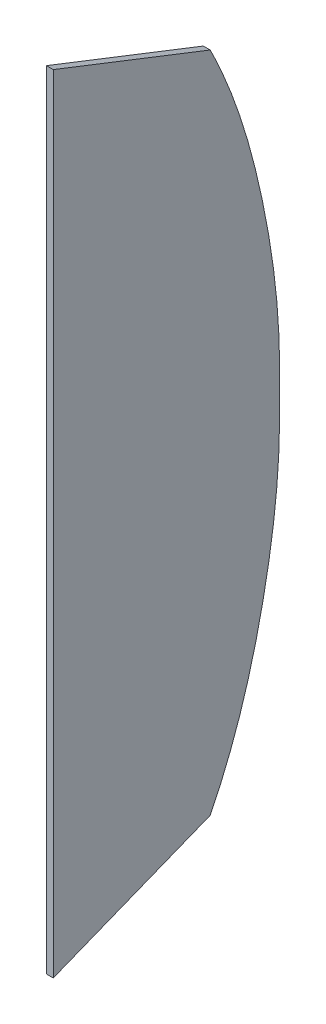
ISO-10303-21;
HEADER;
FILE_DESCRIPTION(('STEP AP214'),'2;1');
FILE_NAME('part.step','',(''),(''),'','','');
FILE_SCHEMA(('AUTOMOTIVE_DESIGN { 1 0 10303 214 1 1 1 1 }'));
ENDSEC;
DATA;
#1=APPLICATION_CONTEXT('core data for automotive mechanical design processes');
#2=APPLICATION_PROTOCOL_DEFINITION('international standard','automotive_design',2000,#1);
#3=PRODUCT_CONTEXT('',#1,'mechanical');
#4=PRODUCT('Part','Part','',(#3));
#5=PRODUCT_RELATED_PRODUCT_CATEGORY('part','',(#4));
#6=PRODUCT_DEFINITION_FORMATION('','',#4);
#7=PRODUCT_DEFINITION_CONTEXT('part definition',#1,'design');
#8=PRODUCT_DEFINITION('design','',#6,#7);
#9=PRODUCT_DEFINITION_SHAPE('','',#8);
#10=(LENGTH_UNIT() NAMED_UNIT(*) SI_UNIT(.MILLI.,.METRE.));
#11=(NAMED_UNIT(*) PLANE_ANGLE_UNIT() SI_UNIT($,.RADIAN.));
#12=(NAMED_UNIT(*) SI_UNIT($,.STERADIAN.) SOLID_ANGLE_UNIT());
#13=UNCERTAINTY_MEASURE_WITH_UNIT(LENGTH_MEASURE(1.E-05),#10,'distance_accuracy_value','');
#14=(GEOMETRIC_REPRESENTATION_CONTEXT(3) GLOBAL_UNCERTAINTY_ASSIGNED_CONTEXT((#13)) GLOBAL_UNIT_ASSIGNED_CONTEXT((#10,
#11,#12)) REPRESENTATION_CONTEXT('',''));
#15=CARTESIAN_POINT('',(0.,0.,0.));
#16=DIRECTION('',(0.,0.,1.));
#17=DIRECTION('',(1.,0.,0.));
#18=AXIS2_PLACEMENT_3D('',#15,#16,#17);
#19=CARTESIAN_POINT('',(9.,-434.591306286478,248.999999691598));
#20=CARTESIAN_POINT('',(9.,-426.266385018669,244.812182663864));
#21=CARTESIAN_POINT('',(9.,-409.423964908326,236.801362844897));
#22=CARTESIAN_POINT('',(9.,-375.149628797293,222.212406313021));
#23=CARTESIAN_POINT('',(9.,-331.259297463056,206.472109959754));
#24=CARTESIAN_POINT('',(9.,-277.308218149153,191.065215125894));
#25=CARTESIAN_POINT('',(9.,-222.427655868533,178.618405136148));
#26=CARTESIAN_POINT('',(9.,-167.061884286646,168.601235655821));
#27=CARTESIAN_POINT('',(9.,-120.681496000962,162.664180797077));
#28=CARTESIAN_POINT('',(9.,-83.4660930358459,159.588454430788));
#29=CARTESIAN_POINT('',(9.,-55.5330096837927,158.191016903717));
#30=CARTESIAN_POINT('',(9.,-27.5061419106363,157.699086860232));
#31=CARTESIAN_POINT('',(9.,0.657149051444837,157.668208507846));
#32=CARTESIAN_POINT('',(9.,28.8204400131948,157.699086883261));
#33=CARTESIAN_POINT('',(9.,56.8473077973295,158.191016915326));
#34=CARTESIAN_POINT('',(9.,84.7803911800562,159.588454358424));
#35=CARTESIAN_POINT('',(9.,121.995794186378,162.664180548182));
#36=CARTESIAN_POINT('',(9.,168.376182512208,168.601235151387));
#37=CARTESIAN_POINT('',(9.,223.741954043314,178.618404527818));
#38=CARTESIAN_POINT('',(9.,278.622516156556,191.065214881807));
#39=CARTESIAN_POINT('',(9.,332.573595341031,206.472110197853));
#40=CARTESIAN_POINT('',(9.,376.463926678336,222.212406757595));
#41=CARTESIAN_POINT('',(9.,410.738262920438,236.801363167192));
#42=CARTESIAN_POINT('',(9.,427.580683135124,244.81218279364));
#43=CARTESIAN_POINT('',(9.,435.905604479438,248.999999691598));
#44=B_SPLINE_CURVE_WITH_KNOTS('',3,(#19,#20,#21,#22,#23,#24,#25,#26,#27,#28,#29,#30,#31,#32,#33,
#34,#35,#36,#37,#38,#39,#40,#41,#42,#43),.UNSPECIFIED.,.F.,.F.,(4,1,1,1,1,1,1,1,1,1,1,1,1,1,1,1,
1,1,1,1,1,1,4),(0.00253448303563442,0.0336260778439174,0.0647176726522003,0.126900862268766,
0.189084051885332,0.251267241501898,0.313450431118464,0.37563362073503,0.406725215543313,
0.437816810351596,0.468908405159879,0.499999999968162,0.531091594776445,0.562183189584728,
0.593274784393011,0.624366379201294,0.68654956881786,0.748732758434425,0.810915948050991,
0.873099137667557,0.935282327284123,0.966373922092406,0.997465516900689),.UNSPECIFIED.);
#45=DIRECTION('',(-1.,0.,0.));
#46=VECTOR('',#45,1.);
#47=SURFACE_OF_LINEAR_EXTRUSION('',#44,#46);
#48=CARTESIAN_POINT('',(0.,-434.591306286478,248.999999691598));
#49=CARTESIAN_POINT('',(0.,-426.266385018669,244.812182663864));
#50=CARTESIAN_POINT('',(0.,-409.423964908326,236.801362844897));
#51=CARTESIAN_POINT('',(0.,-375.149628797293,222.212406313021));
#52=CARTESIAN_POINT('',(0.,-331.259297463056,206.472109959754));
#53=CARTESIAN_POINT('',(0.,-277.308218149153,191.065215125894));
#54=CARTESIAN_POINT('',(0.,-222.427655868533,178.618405136148));
#55=CARTESIAN_POINT('',(0.,-167.061884286646,168.601235655821));
#56=CARTESIAN_POINT('',(0.,-120.681496000962,162.664180797077));
#57=CARTESIAN_POINT('',(0.,-83.4660930358459,159.588454430788));
#58=CARTESIAN_POINT('',(0.,-55.5330096837927,158.191016903717));
#59=CARTESIAN_POINT('',(0.,-27.5061419106363,157.699086860232));
#60=CARTESIAN_POINT('',(0.,0.657149051444837,157.668208507846));
#61=CARTESIAN_POINT('',(0.,28.8204400131948,157.699086883261));
#62=CARTESIAN_POINT('',(0.,56.8473077973295,158.191016915326));
#63=CARTESIAN_POINT('',(0.,84.7803911800562,159.588454358424));
#64=CARTESIAN_POINT('',(0.,121.995794186378,162.664180548182));
#65=CARTESIAN_POINT('',(0.,168.376182512208,168.601235151387));
#66=CARTESIAN_POINT('',(0.,223.741954043314,178.618404527818));
#67=CARTESIAN_POINT('',(0.,278.622516156556,191.065214881807));
#68=CARTESIAN_POINT('',(0.,332.573595341031,206.472110197853));
#69=CARTESIAN_POINT('',(0.,376.463926678336,222.212406757595));
#70=CARTESIAN_POINT('',(0.,410.738262920438,236.801363167192));
#71=CARTESIAN_POINT('',(0.,427.580683135124,244.81218279364));
#72=CARTESIAN_POINT('',(0.,435.905604479438,248.999999691598));
#73=B_SPLINE_CURVE_WITH_KNOTS('',3,(#48,#49,#50,#51,#52,#53,#54,#55,#56,#57,#58,#59,#60,#61,#62,
#63,#64,#65,#66,#67,#68,#69,#70,#71,#72),.UNSPECIFIED.,.F.,.F.,(4,1,1,1,1,1,1,1,1,1,1,1,1,1,1,1,
1,1,1,1,1,1,4),(0.00253448303563442,0.0336260778439174,0.0647176726522003,0.126900862268766,
0.189084051885332,0.251267241501898,0.313450431118464,0.37563362073503,0.406725215543313,
0.437816810351596,0.468908405159879,0.499999999968162,0.531091594776445,0.562183189584728,
0.593274784393011,0.624366379201294,0.68654956881786,0.748732758434425,0.810915948050991,
0.873099137667557,0.935282327284123,0.966373922092406,0.997465516900689),.UNSPECIFIED.);
#74=CARTESIAN_POINT('',(0.,-434.591306286478,248.999999691598));
#75=VERTEX_POINT('',#74);
#76=CARTESIAN_POINT('',(0.,435.905604479438,248.999999691598));
#77=VERTEX_POINT('',#76);
#78=EDGE_CURVE('E96',#75,#77,#73,.T.);
#79=ORIENTED_EDGE('',*,*,#78,.T.);
#80=DIRECTION('',(-1.,0.,0.));
#81=VECTOR('',#80,1.);
#82=CARTESIAN_POINT('',(9.,435.905604479438,248.999999691598));
#83=LINE('',#82,#81);
#84=CARTESIAN_POINT('',(9.,435.905604479438,248.999999691598));
#85=VERTEX_POINT('',#84);
#86=EDGE_CURVE('E11',#85,#77,#83,.T.);
#87=ORIENTED_EDGE('',*,*,#86,.F.);
#88=CARTESIAN_POINT('',(9.,-434.591306286478,248.999999691598));
#89=VERTEX_POINT('',#88);
#90=EDGE_CURVE('E85',#89,#85,#44,.T.);
#91=ORIENTED_EDGE('',*,*,#90,.F.);
#92=DIRECTION('',(-1.,0.,0.));
#93=VECTOR('',#92,1.);
#94=CARTESIAN_POINT('',(9.,-434.591306286478,248.999999691598));
#95=LINE('',#94,#93);
#96=EDGE_CURVE('E93',#89,#75,#95,.T.);
#97=ORIENTED_EDGE('',*,*,#96,.T.);
#98=EDGE_LOOP('',(#79,#87,#91,#97));
#99=FACE_BOUND('',#98,.T.);
#100=ADVANCED_FACE('F33',(#99),#47,.F.);
#101=CARTESIAN_POINT('',(9.,516.556548518137,455.));
#102=DIRECTION('',(0.,-0.931177959031522,0.364564958016935));
#103=DIRECTION('',(0.,-0.364564958016935,-0.931177959031522));
#104=AXIS2_PLACEMENT_3D('',#101,#102,#103);
#105=PLANE('',#104);
#106=DIRECTION('',(0.,0.364564958016935,0.931177959031522));
#107=VECTOR('',#106,1.);
#108=CARTESIAN_POINT('',(0.,516.556548518137,455.));
#109=LINE('',#108,#107);
#110=CARTESIAN_POINT('',(0.,516.556548518137,455.));
#111=VERTEX_POINT('',#110);
#112=EDGE_CURVE('E89',#77,#111,#109,.T.);
#113=ORIENTED_EDGE('',*,*,#112,.T.);
#114=DIRECTION('',(-1.,0.,0.));
#115=VECTOR('',#114,1.);
#116=CARTESIAN_POINT('',(9.,516.556548518137,455.));
#117=LINE('',#116,#115);
#118=CARTESIAN_POINT('',(9.,516.556548518137,455.));
#119=VERTEX_POINT('',#118);
#120=EDGE_CURVE('E42',#119,#111,#117,.T.);
#121=ORIENTED_EDGE('',*,*,#120,.F.);
#122=DIRECTION('',(0.,0.364564958016935,0.931177959031522));
#123=VECTOR('',#122,1.);
#124=CARTESIAN_POINT('',(9.,516.556548518137,455.));
#125=LINE('',#124,#123);
#126=EDGE_CURVE('E80',#85,#119,#125,.T.);
#127=ORIENTED_EDGE('',*,*,#126,.F.);
#128=ORIENTED_EDGE('',*,*,#86,.T.);
#129=EDGE_LOOP('',(#113,#121,#127,#128));
#130=FACE_BOUND('',#129,.T.);
#131=ADVANCED_FACE('F88',(#130),#105,.F.);
#132=CARTESIAN_POINT('',(9.,-516.542644104241,455.));
#133=DIRECTION('',(0.,0.,-1.));
#134=DIRECTION('',(0.,1.,0.));
#135=AXIS2_PLACEMENT_3D('',#132,#133,#134);
#136=PLANE('',#135);
#137=DIRECTION('',(0.,-1.,0.));
#138=VECTOR('',#137,1.);
#139=CARTESIAN_POINT('',(0.,-516.542644104241,455.));
#140=LINE('',#139,#138);
#141=CARTESIAN_POINT('',(0.,-516.542644104241,455.));
#142=VERTEX_POINT('',#141);
#143=EDGE_CURVE('E67',#111,#142,#140,.T.);
#144=ORIENTED_EDGE('',*,*,#143,.T.);
#145=DIRECTION('',(-1.,0.,0.));
#146=VECTOR('',#145,1.);
#147=CARTESIAN_POINT('',(9.,-516.542644104241,455.));
#148=LINE('',#147,#146);
#149=CARTESIAN_POINT('',(9.,-516.542644104241,455.));
#150=VERTEX_POINT('',#149);
#151=EDGE_CURVE('E90',#150,#142,#148,.T.);
#152=ORIENTED_EDGE('',*,*,#151,.F.);
#153=DIRECTION('',(0.,-1.,0.));
#154=VECTOR('',#153,1.);
#155=CARTESIAN_POINT('',(9.,-516.542644104241,455.));
#156=LINE('',#155,#154);
#157=EDGE_CURVE('E83',#119,#150,#156,.T.);
#158=ORIENTED_EDGE('',*,*,#157,.F.);
#159=ORIENTED_EDGE('',*,*,#120,.T.);
#160=EDGE_LOOP('',(#144,#152,#158,#159));
#161=FACE_BOUND('',#160,.T.);
#162=ADVANCED_FACE('F91',(#161),#136,.F.);
#163=CARTESIAN_POINT('',(9.,-516.542644104241,455.));
#164=DIRECTION('',(0.,0.929172883895194,0.369645440704857));
#165=DIRECTION('',(0.,-0.369645440704857,0.929172883895194));
#166=AXIS2_PLACEMENT_3D('',#163,#164,#165);
#167=PLANE('',#166);
#168=DIRECTION('',(0.,0.369645440704857,-0.929172883895194));
#169=VECTOR('',#168,1.);
#170=CARTESIAN_POINT('',(0.,-516.542644104241,455.));
#171=LINE('',#170,#169);
#172=EDGE_CURVE('E73',#142,#75,#171,.T.);
#173=ORIENTED_EDGE('',*,*,#172,.T.);
#174=ORIENTED_EDGE('',*,*,#96,.F.);
#175=DIRECTION('',(0.,0.369645440704857,-0.929172883895194));
#176=VECTOR('',#175,1.);
#177=CARTESIAN_POINT('',(9.,-516.542644104241,455.));
#178=LINE('',#177,#176);
#179=EDGE_CURVE('E50',#150,#89,#178,.T.);
#180=ORIENTED_EDGE('',*,*,#179,.F.);
#181=ORIENTED_EDGE('',*,*,#151,.T.);
#182=EDGE_LOOP('',(#173,#174,#180,#181));
#183=FACE_BOUND('',#182,.T.);
#184=ADVANCED_FACE('F108',(#183),#167,.F.);
#185=CARTESIAN_POINT('',(9.,0.657149051389639,157.678501295813));
#186=DIRECTION('',(1.,0.,0.));
#187=DIRECTION('',(0.,0.,-1.));
#188=AXIS2_PLACEMENT_3D('',#185,#186,#187);
#189=PLANE('',#188);
#190=ORIENTED_EDGE('',*,*,#90,.T.);
#191=ORIENTED_EDGE('',*,*,#126,.T.);
#192=ORIENTED_EDGE('',*,*,#157,.T.);
#193=ORIENTED_EDGE('',*,*,#179,.T.);
#194=EDGE_LOOP('',(#190,#191,#192,#193));
#195=FACE_BOUND('',#194,.T.);
#196=ADVANCED_FACE('F81',(#195),#189,.T.);
#197=CARTESIAN_POINT('',(0.,0.657149051389639,157.678501295813));
#198=DIRECTION('',(1.,0.,0.));
#199=DIRECTION('',(0.,0.,-1.));
#200=AXIS2_PLACEMENT_3D('',#197,#198,#199);
#201=PLANE('',#200);
#202=ORIENTED_EDGE('',*,*,#78,.F.);
#203=ORIENTED_EDGE('',*,*,#172,.F.);
#204=ORIENTED_EDGE('',*,*,#143,.F.);
#205=ORIENTED_EDGE('',*,*,#112,.F.);
#206=EDGE_LOOP('',(#202,#203,#204,#205));
#207=FACE_BOUND('',#206,.T.);
#208=ADVANCED_FACE('F111',(#207),#201,.F.);
#209=CLOSED_SHELL('',(#100,#131,#162,#184,#196,#208));
#210=MANIFOLD_SOLID_BREP('B2',#209);
#211=ADVANCED_BREP_SHAPE_REPRESENTATION('',(#18,#210),#14);
#212=SHAPE_DEFINITION_REPRESENTATION(#9,#211);
ENDSEC;
END-ISO-10303-21;
